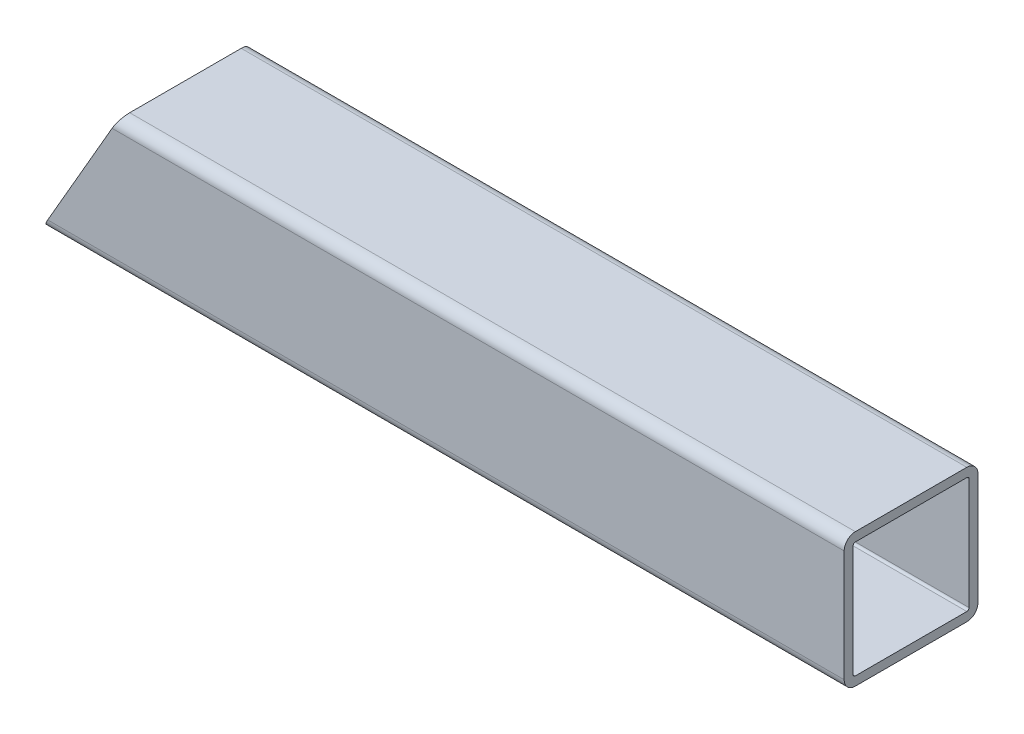
ISO-10303-21;
HEADER;
FILE_DESCRIPTION(('STEP AP214'),'2;1');
FILE_NAME('part.step','',(''),(''),'','','');
FILE_SCHEMA(('AUTOMOTIVE_DESIGN { 1 0 10303 214 1 1 1 1 }'));
ENDSEC;
DATA;
#1=APPLICATION_CONTEXT('core data for automotive mechanical design processes');
#2=APPLICATION_PROTOCOL_DEFINITION('international standard','automotive_design',2000,#1);
#3=PRODUCT_CONTEXT('',#1,'mechanical');
#4=PRODUCT('Part','Part','',(#3));
#5=PRODUCT_RELATED_PRODUCT_CATEGORY('part','',(#4));
#6=PRODUCT_DEFINITION_FORMATION('','',#4);
#7=PRODUCT_DEFINITION_CONTEXT('part definition',#1,'design');
#8=PRODUCT_DEFINITION('design','',#6,#7);
#9=PRODUCT_DEFINITION_SHAPE('','',#8);
#10=(LENGTH_UNIT() NAMED_UNIT(*) SI_UNIT(.MILLI.,.METRE.));
#11=(NAMED_UNIT(*) PLANE_ANGLE_UNIT() SI_UNIT($,.RADIAN.));
#12=(NAMED_UNIT(*) SI_UNIT($,.STERADIAN.) SOLID_ANGLE_UNIT());
#13=UNCERTAINTY_MEASURE_WITH_UNIT(LENGTH_MEASURE(1.E-05),#10,'distance_accuracy_value','');
#14=(GEOMETRIC_REPRESENTATION_CONTEXT(3) GLOBAL_UNCERTAINTY_ASSIGNED_CONTEXT((#13)) GLOBAL_UNIT_ASSIGNED_CONTEXT((#10,
#11,#12)) REPRESENTATION_CONTEXT('',''));
#15=CARTESIAN_POINT('',(0.,0.,0.));
#16=DIRECTION('',(0.,0.,1.));
#17=DIRECTION('',(1.,0.,0.));
#18=AXIS2_PLACEMENT_3D('',#15,#16,#17);
#19=CARTESIAN_POINT('',(114.3,-15.875,15.875));
#20=DIRECTION('',(-1.,0.,0.));
#21=DIRECTION('',(0.,0.,1.));
#22=AXIS2_PLACEMENT_3D('',#19,#20,#21);
#23=CYLINDRICAL_SURFACE('',#22,3.175);
#24=CARTESIAN_POINT('',(-112.466912895323,-15.875,15.875));
#25=DIRECTION('',(-0.866025403784442,0.499999999999995,0.));
#26=DIRECTION('',(-0.499999999999995,-0.866025403784442,0.));
#27=AXIS2_PLACEMENT_3D('',#24,#25,#26);
#28=ELLIPSE('',#27,3.66617420935411,3.175);
#29=CARTESIAN_POINT('',(-114.3,-19.05,15.875));
#30=VERTEX_POINT('',#29);
#31=CARTESIAN_POINT('',(-112.466912895323,-15.875,19.05));
#32=VERTEX_POINT('',#31);
#33=EDGE_CURVE('E286',#30,#32,#28,.T.);
#34=ORIENTED_EDGE('',*,*,#33,.F.);
#35=DIRECTION('',(-1.,0.,0.));
#36=VECTOR('',#35,1.);
#37=CARTESIAN_POINT('',(114.3,-19.05,15.875));
#38=LINE('',#37,#36);
#39=CARTESIAN_POINT('',(114.3,-19.05,15.875));
#40=VERTEX_POINT('',#39);
#41=EDGE_CURVE('E88',#40,#30,#38,.T.);
#42=ORIENTED_EDGE('',*,*,#41,.F.);
#43=CARTESIAN_POINT('',(114.3,-15.875,15.875));
#44=DIRECTION('',(1.,0.,0.));
#45=DIRECTION('',(0.,0.,-1.));
#46=AXIS2_PLACEMENT_3D('',#43,#44,#45);
#47=CIRCLE('',#46,3.175);
#48=CARTESIAN_POINT('',(114.3,-15.875,19.05));
#49=VERTEX_POINT('',#48);
#50=EDGE_CURVE('E242',#49,#40,#47,.T.);
#51=ORIENTED_EDGE('',*,*,#50,.F.);
#52=DIRECTION('',(-1.,0.,0.));
#53=VECTOR('',#52,1.);
#54=CARTESIAN_POINT('',(114.3,-15.875,19.05));
#55=LINE('',#54,#53);
#56=EDGE_CURVE('E259',#49,#32,#55,.T.);
#57=ORIENTED_EDGE('',*,*,#56,.T.);
#58=EDGE_LOOP('',(#34,#42,#51,#57));
#59=FACE_BOUND('',#58,.T.);
#60=ADVANCED_FACE('F81',(#59),#23,.T.);
#61=CARTESIAN_POINT('',(114.3,-15.875,-15.875));
#62=DIRECTION('',(-1.,0.,0.));
#63=DIRECTION('',(0.,0.,1.));
#64=AXIS2_PLACEMENT_3D('',#61,#62,#63);
#65=CYLINDRICAL_SURFACE('',#64,3.175);
#66=CARTESIAN_POINT('',(-112.466912895323,-15.875,-15.875));
#67=DIRECTION('',(-0.866025403784442,0.499999999999995,0.));
#68=DIRECTION('',(-0.499999999999995,-0.866025403784442,0.));
#69=AXIS2_PLACEMENT_3D('',#66,#67,#68);
#70=ELLIPSE('',#69,3.66617420935411,3.175);
#71=CARTESIAN_POINT('',(-112.466912895323,-15.875,-19.05));
#72=VERTEX_POINT('',#71);
#73=CARTESIAN_POINT('',(-114.3,-19.05,-15.875));
#74=VERTEX_POINT('',#73);
#75=EDGE_CURVE('E95',#72,#74,#70,.T.);
#76=ORIENTED_EDGE('',*,*,#75,.F.);
#77=DIRECTION('',(-1.,0.,0.));
#78=VECTOR('',#77,1.);
#79=CARTESIAN_POINT('',(114.3,-15.875,-19.05));
#80=LINE('',#79,#78);
#81=CARTESIAN_POINT('',(114.3,-15.875,-19.05));
#82=VERTEX_POINT('',#81);
#83=EDGE_CURVE('E273',#82,#72,#80,.T.);
#84=ORIENTED_EDGE('',*,*,#83,.F.);
#85=CARTESIAN_POINT('',(114.3,-15.875,-15.875));
#86=DIRECTION('',(1.,0.,0.));
#87=DIRECTION('',(0.,0.,-1.));
#88=AXIS2_PLACEMENT_3D('',#85,#86,#87);
#89=CIRCLE('',#88,3.175);
#90=CARTESIAN_POINT('',(114.3,-19.05,-15.875));
#91=VERTEX_POINT('',#90);
#92=EDGE_CURVE('E247',#91,#82,#89,.T.);
#93=ORIENTED_EDGE('',*,*,#92,.F.);
#94=DIRECTION('',(-1.,0.,0.));
#95=VECTOR('',#94,1.);
#96=CARTESIAN_POINT('',(114.3,-19.05,-15.875));
#97=LINE('',#96,#95);
#98=EDGE_CURVE('E275',#91,#74,#97,.T.);
#99=ORIENTED_EDGE('',*,*,#98,.T.);
#100=EDGE_LOOP('',(#76,#84,#93,#99));
#101=FACE_BOUND('',#100,.T.);
#102=ADVANCED_FACE('F345',(#101),#65,.T.);
#103=CARTESIAN_POINT('',(114.3,15.875,-19.05));
#104=DIRECTION('',(0.,0.,1.));
#105=DIRECTION('',(0.,-1.,0.));
#106=AXIS2_PLACEMENT_3D('',#103,#104,#105);
#107=PLANE('',#106);
#108=DIRECTION('',(-0.499999999999995,-0.866025403784442,0.));
#109=VECTOR('',#108,1.);
#110=CARTESIAN_POINT('',(-42.0270313864156,106.130453652561,-19.05));
#111=LINE('',#110,#109);
#112=CARTESIAN_POINT('',(-94.1360418485526,15.875,-19.05));
#113=VERTEX_POINT('',#112);
#114=EDGE_CURVE('E102',#113,#72,#111,.T.);
#115=ORIENTED_EDGE('',*,*,#114,.F.);
#116=DIRECTION('',(-1.,0.,0.));
#117=VECTOR('',#116,1.);
#118=CARTESIAN_POINT('',(114.3,15.875,-19.05));
#119=LINE('',#118,#117);
#120=CARTESIAN_POINT('',(114.3,15.875,-19.05));
#121=VERTEX_POINT('',#120);
#122=EDGE_CURVE('E271',#121,#113,#119,.T.);
#123=ORIENTED_EDGE('',*,*,#122,.F.);
#124=DIRECTION('',(0.,1.,0.));
#125=VECTOR('',#124,1.);
#126=CARTESIAN_POINT('',(114.3,15.875,-19.05));
#127=LINE('',#126,#125);
#128=EDGE_CURVE('E249',#82,#121,#127,.T.);
#129=ORIENTED_EDGE('',*,*,#128,.F.);
#130=ORIENTED_EDGE('',*,*,#83,.T.);
#131=EDGE_LOOP('',(#115,#123,#129,#130));
#132=FACE_BOUND('',#131,.T.);
#133=ADVANCED_FACE('F343',(#132),#107,.F.);
#134=CARTESIAN_POINT('',(114.3,15.875,-15.875));
#135=DIRECTION('',(-1.,0.,0.));
#136=DIRECTION('',(0.,0.,1.));
#137=AXIS2_PLACEMENT_3D('',#134,#135,#136);
#138=CYLINDRICAL_SURFACE('',#137,3.175);
#139=CARTESIAN_POINT('',(-94.1360418485526,15.875,-15.875));
#140=DIRECTION('',(-0.866025403784442,0.499999999999995,0.));
#141=DIRECTION('',(-0.499999999999995,-0.866025403784442,0.));
#142=AXIS2_PLACEMENT_3D('',#139,#140,#141);
#143=ELLIPSE('',#142,3.66617420935411,3.175);
#144=CARTESIAN_POINT('',(-92.3029547438756,19.05,-15.875));
#145=VERTEX_POINT('',#144);
#146=EDGE_CURVE('E292',#145,#113,#143,.T.);
#147=ORIENTED_EDGE('',*,*,#146,.F.);
#148=DIRECTION('',(-1.,0.,0.));
#149=VECTOR('',#148,1.);
#150=CARTESIAN_POINT('',(114.3,19.05,-15.875));
#151=LINE('',#150,#149);
#152=CARTESIAN_POINT('',(114.3,19.05,-15.875));
#153=VERTEX_POINT('',#152);
#154=EDGE_CURVE('E268',#153,#145,#151,.T.);
#155=ORIENTED_EDGE('',*,*,#154,.F.);
#156=CARTESIAN_POINT('',(114.3,15.875,-15.875));
#157=DIRECTION('',(1.,0.,0.));
#158=DIRECTION('',(0.,0.,-1.));
#159=AXIS2_PLACEMENT_3D('',#156,#157,#158);
#160=CIRCLE('',#159,3.175);
#161=EDGE_CURVE('E251',#121,#153,#160,.T.);
#162=ORIENTED_EDGE('',*,*,#161,.F.);
#163=ORIENTED_EDGE('',*,*,#122,.T.);
#164=EDGE_LOOP('',(#147,#155,#162,#163));
#165=FACE_BOUND('',#164,.T.);
#166=ADVANCED_FACE('F332',(#165),#138,.T.);
#167=CARTESIAN_POINT('',(114.3,19.05,15.875));
#168=DIRECTION('',(0.,-1.,0.));
#169=DIRECTION('',(0.,0.,-1.));
#170=AXIS2_PLACEMENT_3D('',#167,#168,#169);
#171=PLANE('',#170);
#172=DIRECTION('',(0.,0.,-1.));
#173=VECTOR('',#172,1.);
#174=CARTESIAN_POINT('',(-92.3029547438756,19.05,316.598966891398));
#175=LINE('',#174,#173);
#176=CARTESIAN_POINT('',(-92.3029547438755,19.05,15.875));
#177=VERTEX_POINT('',#176);
#178=EDGE_CURVE('E329',#177,#145,#175,.T.);
#179=ORIENTED_EDGE('',*,*,#178,.F.);
#180=DIRECTION('',(-1.,0.,0.));
#181=VECTOR('',#180,1.);
#182=CARTESIAN_POINT('',(114.3,19.05,15.875));
#183=LINE('',#182,#181);
#184=CARTESIAN_POINT('',(114.3,19.05,15.875));
#185=VERTEX_POINT('',#184);
#186=EDGE_CURVE('E265',#185,#177,#183,.T.);
#187=ORIENTED_EDGE('',*,*,#186,.F.);
#188=DIRECTION('',(0.,0.,1.));
#189=VECTOR('',#188,1.);
#190=CARTESIAN_POINT('',(114.3,19.05,15.875));
#191=LINE('',#190,#189);
#192=EDGE_CURVE('E253',#153,#185,#191,.T.);
#193=ORIENTED_EDGE('',*,*,#192,.F.);
#194=ORIENTED_EDGE('',*,*,#154,.T.);
#195=EDGE_LOOP('',(#179,#187,#193,#194));
#196=FACE_BOUND('',#195,.T.);
#197=ADVANCED_FACE('F336',(#196),#171,.F.);
#198=CARTESIAN_POINT('',(114.3,15.875,15.875));
#199=DIRECTION('',(-1.,0.,0.));
#200=DIRECTION('',(0.,0.,1.));
#201=AXIS2_PLACEMENT_3D('',#198,#199,#200);
#202=CYLINDRICAL_SURFACE('',#201,3.175);
#203=CARTESIAN_POINT('',(-94.1360418485526,15.875,15.875));
#204=DIRECTION('',(-0.866025403784442,0.499999999999995,0.));
#205=DIRECTION('',(-0.499999999999995,-0.866025403784442,0.));
#206=AXIS2_PLACEMENT_3D('',#203,#204,#205);
#207=ELLIPSE('',#206,3.66617420935411,3.175);
#208=CARTESIAN_POINT('',(-94.1360418485526,15.875,19.05));
#209=VERTEX_POINT('',#208);
#210=EDGE_CURVE('E325',#209,#177,#207,.T.);
#211=ORIENTED_EDGE('',*,*,#210,.F.);
#212=DIRECTION('',(-1.,0.,0.));
#213=VECTOR('',#212,1.);
#214=CARTESIAN_POINT('',(114.3,15.875,19.05));
#215=LINE('',#214,#213);
#216=CARTESIAN_POINT('',(114.3,15.875,19.05));
#217=VERTEX_POINT('',#216);
#218=EDGE_CURVE('E263',#217,#209,#215,.T.);
#219=ORIENTED_EDGE('',*,*,#218,.F.);
#220=CARTESIAN_POINT('',(114.3,15.875,15.875));
#221=DIRECTION('',(1.,0.,0.));
#222=DIRECTION('',(0.,0.,-1.));
#223=AXIS2_PLACEMENT_3D('',#220,#221,#222);
#224=CIRCLE('',#223,3.175);
#225=EDGE_CURVE('E255',#185,#217,#224,.T.);
#226=ORIENTED_EDGE('',*,*,#225,.F.);
#227=ORIENTED_EDGE('',*,*,#186,.T.);
#228=EDGE_LOOP('',(#211,#219,#226,#227));
#229=FACE_BOUND('',#228,.T.);
#230=ADVANCED_FACE('F362',(#229),#202,.T.);
#231=CARTESIAN_POINT('',(114.3,15.875,19.05));
#232=DIRECTION('',(0.,0.,-1.));
#233=DIRECTION('',(0.,1.,0.));
#234=AXIS2_PLACEMENT_3D('',#231,#232,#233);
#235=PLANE('',#234);
#236=DIRECTION('',(0.499999999999995,0.866025403784442,0.));
#237=VECTOR('',#236,1.);
#238=CARTESIAN_POINT('',(-42.0270313864156,106.130453652561,19.05));
#239=LINE('',#238,#237);
#240=EDGE_CURVE('E212',#32,#209,#239,.T.);
#241=ORIENTED_EDGE('',*,*,#240,.F.);
#242=ORIENTED_EDGE('',*,*,#56,.F.);
#243=DIRECTION('',(0.,-1.,0.));
#244=VECTOR('',#243,1.);
#245=CARTESIAN_POINT('',(114.3,15.875,19.05));
#246=LINE('',#245,#244);
#247=EDGE_CURVE('E257',#217,#49,#246,.T.);
#248=ORIENTED_EDGE('',*,*,#247,.F.);
#249=ORIENTED_EDGE('',*,*,#218,.T.);
#250=EDGE_LOOP('',(#241,#242,#248,#249));
#251=FACE_BOUND('',#250,.T.);
#252=ADVANCED_FACE('F359',(#251),#235,.F.);
#253=CARTESIAN_POINT('',(114.3,-15.875,15.875));
#254=DIRECTION('',(-1.,0.,0.));
#255=DIRECTION('',(0.,0.,1.));
#256=AXIS2_PLACEMENT_3D('',#253,#254,#255);
#257=CYLINDRICAL_SURFACE('',#256,0.635000000000002);
#258=DIRECTION('',(-1.,0.,0.));
#259=VECTOR('',#258,1.);
#260=CARTESIAN_POINT('',(114.3,-16.51,15.875));
#261=LINE('',#260,#259);
#262=CARTESIAN_POINT('',(114.3,-16.51,15.875));
#263=VERTEX_POINT('',#262);
#264=CARTESIAN_POINT('',(-112.833530316258,-16.51,15.875));
#265=VERTEX_POINT('',#264);
#266=EDGE_CURVE('E211',#263,#265,#261,.T.);
#267=ORIENTED_EDGE('',*,*,#266,.T.);
#268=CARTESIAN_POINT('',(-112.466912895323,-15.875,15.875));
#269=DIRECTION('',(-0.866025403784442,0.499999999999995,0.));
#270=DIRECTION('',(-0.499999999999995,-0.866025403784442,0.));
#271=AXIS2_PLACEMENT_3D('',#268,#269,#270);
#272=ELLIPSE('',#271,0.733234841870825,0.635000000000002);
#273=CARTESIAN_POINT('',(-112.466912895323,-15.875,16.51));
#274=VERTEX_POINT('',#273);
#275=EDGE_CURVE('E197',#265,#274,#272,.T.);
#276=ORIENTED_EDGE('',*,*,#275,.T.);
#277=DIRECTION('',(-1.,0.,0.));
#278=VECTOR('',#277,1.);
#279=CARTESIAN_POINT('',(114.3,-15.875,16.51));
#280=LINE('',#279,#278);
#281=CARTESIAN_POINT('',(114.3,-15.875,16.51));
#282=VERTEX_POINT('',#281);
#283=EDGE_CURVE('E208',#282,#274,#280,.T.);
#284=ORIENTED_EDGE('',*,*,#283,.F.);
#285=CARTESIAN_POINT('',(114.3,-15.875,15.875));
#286=DIRECTION('',(1.,0.,0.));
#287=DIRECTION('',(0.,0.,-1.));
#288=AXIS2_PLACEMENT_3D('',#285,#286,#287);
#289=CIRCLE('',#288,0.635000000000002);
#290=EDGE_CURVE('E288',#282,#263,#289,.T.);
#291=ORIENTED_EDGE('',*,*,#290,.T.);
#292=EDGE_LOOP('',(#267,#276,#284,#291));
#293=FACE_BOUND('',#292,.T.);
#294=ADVANCED_FACE('F207',(#293),#257,.F.);
#295=CARTESIAN_POINT('',(114.3,-16.51,15.875));
#296=DIRECTION('',(0.,1.,0.));
#297=DIRECTION('',(0.,0.,1.));
#298=AXIS2_PLACEMENT_3D('',#295,#296,#297);
#299=PLANE('',#298);
#300=DIRECTION('',(-1.,0.,0.));
#301=VECTOR('',#300,1.);
#302=CARTESIAN_POINT('',(114.3,-16.51,-15.875));
#303=LINE('',#302,#301);
#304=CARTESIAN_POINT('',(114.3,-16.51,-15.875));
#305=VERTEX_POINT('',#304);
#306=CARTESIAN_POINT('',(-112.833530316258,-16.51,-15.875));
#307=VERTEX_POINT('',#306);
#308=EDGE_CURVE('E237',#305,#307,#303,.T.);
#309=ORIENTED_EDGE('',*,*,#308,.T.);
#310=DIRECTION('',(0.,0.,1.));
#311=VECTOR('',#310,1.);
#312=CARTESIAN_POINT('',(-112.833530316258,-16.51,15.875));
#313=LINE('',#312,#311);
#314=EDGE_CURVE('E213',#307,#265,#313,.T.);
#315=ORIENTED_EDGE('',*,*,#314,.T.);
#316=ORIENTED_EDGE('',*,*,#266,.F.);
#317=DIRECTION('',(0.,0.,-1.));
#318=VECTOR('',#317,1.);
#319=CARTESIAN_POINT('',(114.3,-16.51,15.875));
#320=LINE('',#319,#318);
#321=EDGE_CURVE('E290',#263,#305,#320,.T.);
#322=ORIENTED_EDGE('',*,*,#321,.T.);
#323=EDGE_LOOP('',(#309,#315,#316,#322));
#324=FACE_BOUND('',#323,.T.);
#325=ADVANCED_FACE('F315',(#324),#299,.T.);
#326=CARTESIAN_POINT('',(114.3,-15.875,-15.875));
#327=DIRECTION('',(-1.,0.,0.));
#328=DIRECTION('',(0.,0.,1.));
#329=AXIS2_PLACEMENT_3D('',#326,#327,#328);
#330=CYLINDRICAL_SURFACE('',#329,0.634999999999999);
#331=DIRECTION('',(-1.,0.,0.));
#332=VECTOR('',#331,1.);
#333=CARTESIAN_POINT('',(114.3,-15.875,-16.51));
#334=LINE('',#333,#332);
#335=CARTESIAN_POINT('',(114.3,-15.875,-16.51));
#336=VERTEX_POINT('',#335);
#337=CARTESIAN_POINT('',(-112.466912895323,-15.875,-16.51));
#338=VERTEX_POINT('',#337);
#339=EDGE_CURVE('E234',#336,#338,#334,.T.);
#340=ORIENTED_EDGE('',*,*,#339,.T.);
#341=CARTESIAN_POINT('',(-112.466912895323,-15.875,-15.875));
#342=DIRECTION('',(-0.866025403784442,0.499999999999995,0.));
#343=DIRECTION('',(-0.499999999999995,-0.866025403784442,0.));
#344=AXIS2_PLACEMENT_3D('',#341,#342,#343);
#345=ELLIPSE('',#344,0.733234841870821,0.634999999999999);
#346=EDGE_CURVE('E318',#338,#307,#345,.T.);
#347=ORIENTED_EDGE('',*,*,#346,.T.);
#348=ORIENTED_EDGE('',*,*,#308,.F.);
#349=CARTESIAN_POINT('',(114.3,-15.875,-15.875));
#350=DIRECTION('',(1.,0.,0.));
#351=DIRECTION('',(0.,0.,-1.));
#352=AXIS2_PLACEMENT_3D('',#349,#350,#351);
#353=CIRCLE('',#352,0.634999999999999);
#354=EDGE_CURVE('E297',#305,#336,#353,.T.);
#355=ORIENTED_EDGE('',*,*,#354,.T.);
#356=EDGE_LOOP('',(#340,#347,#348,#355));
#357=FACE_BOUND('',#356,.T.);
#358=ADVANCED_FACE('F378',(#357),#330,.F.);
#359=CARTESIAN_POINT('',(114.3,15.875,-16.51));
#360=DIRECTION('',(0.,0.,1.));
#361=DIRECTION('',(0.,-1.,0.));
#362=AXIS2_PLACEMENT_3D('',#359,#360,#361);
#363=PLANE('',#362);
#364=DIRECTION('',(-1.,0.,0.));
#365=VECTOR('',#364,1.);
#366=CARTESIAN_POINT('',(114.3,15.875,-16.51));
#367=LINE('',#366,#365);
#368=CARTESIAN_POINT('',(114.3,15.875,-16.51));
#369=VERTEX_POINT('',#368);
#370=CARTESIAN_POINT('',(-94.1360418485526,15.875,-16.51));
#371=VERTEX_POINT('',#370);
#372=EDGE_CURVE('E231',#369,#371,#367,.T.);
#373=ORIENTED_EDGE('',*,*,#372,.T.);
#374=DIRECTION('',(-0.499999999999995,-0.866025403784442,0.));
#375=VECTOR('',#374,1.);
#376=CARTESIAN_POINT('',(-42.0270313864156,106.130453652561,-16.51));
#377=LINE('',#376,#375);
#378=EDGE_CURVE('E320',#371,#338,#377,.T.);
#379=ORIENTED_EDGE('',*,*,#378,.T.);
#380=ORIENTED_EDGE('',*,*,#339,.F.);
#381=DIRECTION('',(0.,1.,0.));
#382=VECTOR('',#381,1.);
#383=CARTESIAN_POINT('',(114.3,15.875,-16.51));
#384=LINE('',#383,#382);
#385=EDGE_CURVE('E299',#336,#369,#384,.T.);
#386=ORIENTED_EDGE('',*,*,#385,.T.);
#387=EDGE_LOOP('',(#373,#379,#380,#386));
#388=FACE_BOUND('',#387,.T.);
#389=ADVANCED_FACE('F381',(#388),#363,.T.);
#390=CARTESIAN_POINT('',(114.3,15.875,-15.875));
#391=DIRECTION('',(-1.,0.,0.));
#392=DIRECTION('',(0.,0.,1.));
#393=AXIS2_PLACEMENT_3D('',#390,#391,#392);
#394=CYLINDRICAL_SURFACE('',#393,0.635000000000004);
#395=DIRECTION('',(-1.,0.,0.));
#396=VECTOR('',#395,1.);
#397=CARTESIAN_POINT('',(114.3,16.51,-15.875));
#398=LINE('',#397,#396);
#399=CARTESIAN_POINT('',(114.3,16.51,-15.875));
#400=VERTEX_POINT('',#399);
#401=CARTESIAN_POINT('',(-93.7694244276172,16.51,-15.875));
#402=VERTEX_POINT('',#401);
#403=EDGE_CURVE('E228',#400,#402,#398,.T.);
#404=ORIENTED_EDGE('',*,*,#403,.T.);
#405=CARTESIAN_POINT('',(-94.1360418485526,15.875,-15.875));
#406=DIRECTION('',(-0.866025403784442,0.499999999999995,0.));
#407=DIRECTION('',(-0.499999999999995,-0.866025403784442,0.));
#408=AXIS2_PLACEMENT_3D('',#405,#406,#407);
#409=ELLIPSE('',#408,0.733234841870827,0.635000000000004);
#410=EDGE_CURVE('E509',#402,#371,#409,.T.);
#411=ORIENTED_EDGE('',*,*,#410,.T.);
#412=ORIENTED_EDGE('',*,*,#372,.F.);
#413=CARTESIAN_POINT('',(114.3,15.875,-15.875));
#414=DIRECTION('',(1.,0.,0.));
#415=DIRECTION('',(0.,0.,-1.));
#416=AXIS2_PLACEMENT_3D('',#413,#414,#415);
#417=CIRCLE('',#416,0.635000000000004);
#418=EDGE_CURVE('E301',#369,#400,#417,.T.);
#419=ORIENTED_EDGE('',*,*,#418,.T.);
#420=EDGE_LOOP('',(#404,#411,#412,#419));
#421=FACE_BOUND('',#420,.T.);
#422=ADVANCED_FACE('F385',(#421),#394,.F.);
#423=CARTESIAN_POINT('',(114.3,16.51,15.875));
#424=DIRECTION('',(0.,-1.,0.));
#425=DIRECTION('',(0.,0.,-1.));
#426=AXIS2_PLACEMENT_3D('',#423,#424,#425);
#427=PLANE('',#426);
#428=DIRECTION('',(-1.,0.,0.));
#429=VECTOR('',#428,1.);
#430=CARTESIAN_POINT('',(114.3,16.51,15.875));
#431=LINE('',#430,#429);
#432=CARTESIAN_POINT('',(114.3,16.51,15.875));
#433=VERTEX_POINT('',#432);
#434=CARTESIAN_POINT('',(-93.7694244276172,16.51,15.875));
#435=VERTEX_POINT('',#434);
#436=EDGE_CURVE('E220',#433,#435,#431,.T.);
#437=ORIENTED_EDGE('',*,*,#436,.T.);
#438=DIRECTION('',(0.,0.,-1.));
#439=VECTOR('',#438,1.);
#440=CARTESIAN_POINT('',(-93.7694244276172,16.51,15.875));
#441=LINE('',#440,#439);
#442=EDGE_CURVE('E504',#435,#402,#441,.T.);
#443=ORIENTED_EDGE('',*,*,#442,.T.);
#444=ORIENTED_EDGE('',*,*,#403,.F.);
#445=DIRECTION('',(0.,0.,1.));
#446=VECTOR('',#445,1.);
#447=CARTESIAN_POINT('',(114.3,16.51,15.875));
#448=LINE('',#447,#446);
#449=EDGE_CURVE('E303',#400,#433,#448,.T.);
#450=ORIENTED_EDGE('',*,*,#449,.T.);
#451=EDGE_LOOP('',(#437,#443,#444,#450));
#452=FACE_BOUND('',#451,.T.);
#453=ADVANCED_FACE('F389',(#452),#427,.T.);
#454=CARTESIAN_POINT('',(114.3,15.875,15.875));
#455=DIRECTION('',(-1.,0.,0.));
#456=DIRECTION('',(0.,0.,1.));
#457=AXIS2_PLACEMENT_3D('',#454,#455,#456);
#458=CYLINDRICAL_SURFACE('',#457,0.635000000000004);
#459=DIRECTION('',(-1.,0.,0.));
#460=VECTOR('',#459,1.);
#461=CARTESIAN_POINT('',(114.3,15.875,16.51));
#462=LINE('',#461,#460);
#463=CARTESIAN_POINT('',(114.3,15.875,16.51));
#464=VERTEX_POINT('',#463);
#465=CARTESIAN_POINT('',(-94.1360418485526,15.875,16.51));
#466=VERTEX_POINT('',#465);
#467=EDGE_CURVE('E218',#464,#466,#462,.T.);
#468=ORIENTED_EDGE('',*,*,#467,.T.);
#469=CARTESIAN_POINT('',(-94.1360418485526,15.875,15.875));
#470=DIRECTION('',(-0.866025403784442,0.499999999999995,0.));
#471=DIRECTION('',(-0.499999999999995,-0.866025403784442,0.));
#472=AXIS2_PLACEMENT_3D('',#469,#470,#471);
#473=ELLIPSE('',#472,0.733234841870827,0.635000000000004);
#474=EDGE_CURVE('E200',#466,#435,#473,.T.);
#475=ORIENTED_EDGE('',*,*,#474,.T.);
#476=ORIENTED_EDGE('',*,*,#436,.F.);
#477=CARTESIAN_POINT('',(114.3,15.875,15.875));
#478=DIRECTION('',(1.,0.,0.));
#479=DIRECTION('',(0.,0.,-1.));
#480=AXIS2_PLACEMENT_3D('',#477,#478,#479);
#481=CIRCLE('',#480,0.635000000000004);
#482=EDGE_CURVE('E222',#433,#464,#481,.T.);
#483=ORIENTED_EDGE('',*,*,#482,.T.);
#484=EDGE_LOOP('',(#468,#475,#476,#483));
#485=FACE_BOUND('',#484,.T.);
#486=ADVANCED_FACE('F308',(#485),#458,.F.);
#487=CARTESIAN_POINT('',(114.3,15.875,16.51));
#488=DIRECTION('',(0.,0.,-1.));
#489=DIRECTION('',(0.,1.,0.));
#490=AXIS2_PLACEMENT_3D('',#487,#488,#489);
#491=PLANE('',#490);
#492=ORIENTED_EDGE('',*,*,#283,.T.);
#493=DIRECTION('',(0.499999999999995,0.866025403784442,0.));
#494=VECTOR('',#493,1.);
#495=CARTESIAN_POINT('',(-42.0270313864156,106.130453652561,16.51));
#496=LINE('',#495,#494);
#497=EDGE_CURVE('E12',#274,#466,#496,.T.);
#498=ORIENTED_EDGE('',*,*,#497,.T.);
#499=ORIENTED_EDGE('',*,*,#467,.F.);
#500=DIRECTION('',(0.,-1.,0.));
#501=VECTOR('',#500,1.);
#502=CARTESIAN_POINT('',(114.3,15.875,16.51));
#503=LINE('',#502,#501);
#504=EDGE_CURVE('E217',#464,#282,#503,.T.);
#505=ORIENTED_EDGE('',*,*,#504,.T.);
#506=EDGE_LOOP('',(#492,#498,#499,#505));
#507=FACE_BOUND('',#506,.T.);
#508=ADVANCED_FACE('F215',(#507),#491,.T.);
#509=CARTESIAN_POINT('',(114.3,-15.875,15.875));
#510=DIRECTION('',(1.,0.,0.));
#511=DIRECTION('',(0.,0.,-1.));
#512=AXIS2_PLACEMENT_3D('',#509,#510,#511);
#513=PLANE('',#512);
#514=ORIENTED_EDGE('',*,*,#50,.T.);
#515=DIRECTION('',(0.,0.,-1.));
#516=VECTOR('',#515,1.);
#517=CARTESIAN_POINT('',(114.3,-19.05,15.875));
#518=LINE('',#517,#516);
#519=EDGE_CURVE('E245',#40,#91,#518,.T.);
#520=ORIENTED_EDGE('',*,*,#519,.T.);
#521=ORIENTED_EDGE('',*,*,#92,.T.);
#522=ORIENTED_EDGE('',*,*,#128,.T.);
#523=ORIENTED_EDGE('',*,*,#161,.T.);
#524=ORIENTED_EDGE('',*,*,#192,.T.);
#525=ORIENTED_EDGE('',*,*,#225,.T.);
#526=ORIENTED_EDGE('',*,*,#247,.T.);
#527=EDGE_LOOP('',(#514,#520,#521,#522,#523,#524,#525,#526));
#528=FACE_BOUND('',#527,.T.);
#529=ORIENTED_EDGE('',*,*,#321,.F.);
#530=ORIENTED_EDGE('',*,*,#290,.F.);
#531=ORIENTED_EDGE('',*,*,#504,.F.);
#532=ORIENTED_EDGE('',*,*,#482,.F.);
#533=ORIENTED_EDGE('',*,*,#449,.F.);
#534=ORIENTED_EDGE('',*,*,#418,.F.);
#535=ORIENTED_EDGE('',*,*,#385,.F.);
#536=ORIENTED_EDGE('',*,*,#354,.F.);
#537=EDGE_LOOP('',(#529,#530,#531,#532,#533,#534,#535,#536));
#538=FACE_BOUND('',#537,.T.);
#539=ADVANCED_FACE('F312',(#528,#538),#513,.T.);
#540=CARTESIAN_POINT('',(114.3,-19.05,15.875));
#541=DIRECTION('',(0.,1.,0.));
#542=DIRECTION('',(0.,0.,1.));
#543=AXIS2_PLACEMENT_3D('',#540,#541,#542);
#544=PLANE('',#543);
#545=DIRECTION('',(0.,0.,-1.));
#546=VECTOR('',#545,1.);
#547=CARTESIAN_POINT('',(-114.3,-19.05,15.875));
#548=LINE('',#547,#546);
#549=EDGE_CURVE('E241',#30,#74,#548,.T.);
#550=ORIENTED_EDGE('',*,*,#549,.T.);
#551=ORIENTED_EDGE('',*,*,#98,.F.);
#552=ORIENTED_EDGE('',*,*,#519,.F.);
#553=ORIENTED_EDGE('',*,*,#41,.T.);
#554=EDGE_LOOP('',(#550,#551,#552,#553));
#555=FACE_BOUND('',#554,.T.);
#556=ADVANCED_FACE('F280',(#555),#544,.F.);
#557=CARTESIAN_POINT('',(-114.3,-19.05,316.598966891398));
#558=DIRECTION('',(-0.866025403784442,0.499999999999995,0.));
#559=DIRECTION('',(-0.499999999999995,-0.866025403784442,0.));
#560=AXIS2_PLACEMENT_3D('',#557,#558,#559);
#561=PLANE('',#560);
#562=ORIENTED_EDGE('',*,*,#275,.F.);
#563=ORIENTED_EDGE('',*,*,#314,.F.);
#564=ORIENTED_EDGE('',*,*,#346,.F.);
#565=ORIENTED_EDGE('',*,*,#378,.F.);
#566=ORIENTED_EDGE('',*,*,#410,.F.);
#567=ORIENTED_EDGE('',*,*,#442,.F.);
#568=ORIENTED_EDGE('',*,*,#474,.F.);
#569=ORIENTED_EDGE('',*,*,#497,.F.);
#570=EDGE_LOOP('',(#562,#563,#564,#565,#566,#567,#568,#569));
#571=FACE_BOUND('',#570,.T.);
#572=ORIENTED_EDGE('',*,*,#114,.T.);
#573=ORIENTED_EDGE('',*,*,#75,.T.);
#574=ORIENTED_EDGE('',*,*,#549,.F.);
#575=ORIENTED_EDGE('',*,*,#33,.T.);
#576=ORIENTED_EDGE('',*,*,#240,.T.);
#577=ORIENTED_EDGE('',*,*,#210,.T.);
#578=ORIENTED_EDGE('',*,*,#178,.T.);
#579=ORIENTED_EDGE('',*,*,#146,.T.);
#580=EDGE_LOOP('',(#572,#573,#574,#575,#576,#577,#578,#579));
#581=FACE_BOUND('',#580,.T.);
#582=ADVANCED_FACE('F195',(#571,#581),#561,.T.);
#583=CLOSED_SHELL('',(#60,#102,#133,#166,#197,#230,#252,#294,#325,#358,#389,#422,#453,#486,#508,
#539,#556,#582));
#584=MANIFOLD_SOLID_BREP('B2',#583);
#585=ADVANCED_BREP_SHAPE_REPRESENTATION('',(#18,#584),#14);
#586=SHAPE_DEFINITION_REPRESENTATION(#9,#585);
ENDSEC;
END-ISO-10303-21;
